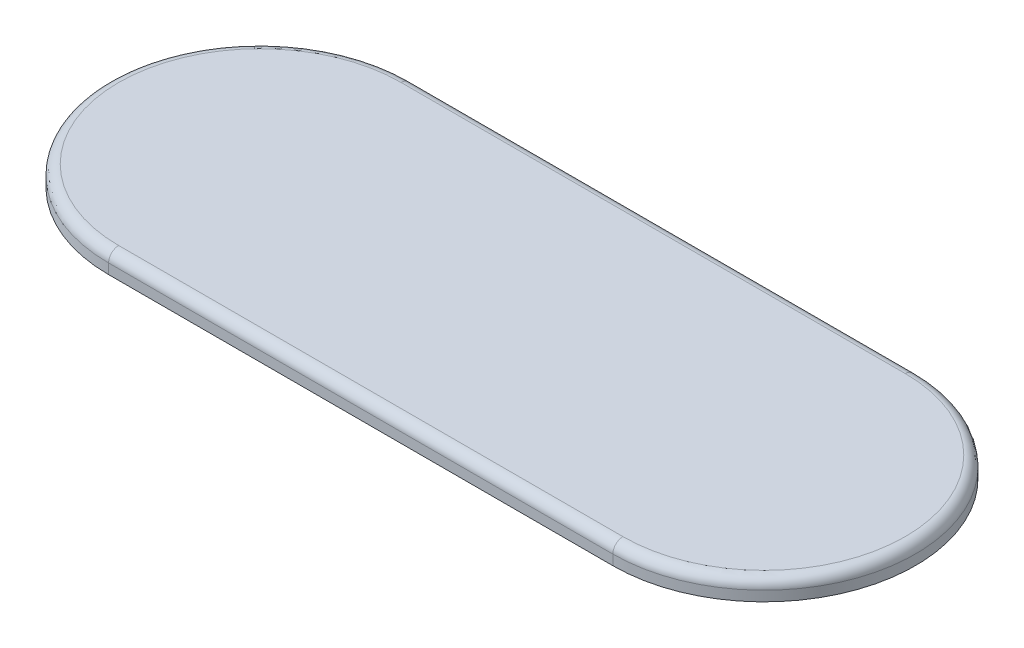
ISO-10303-21;
HEADER;
FILE_DESCRIPTION(('STEP AP214'),'2;1');
FILE_NAME('part.step','',(''),(''),'','','');
FILE_SCHEMA(('AUTOMOTIVE_DESIGN { 1 0 10303 214 1 1 1 1 }'));
ENDSEC;
DATA;
#1=APPLICATION_CONTEXT('core data for automotive mechanical design processes');
#2=APPLICATION_PROTOCOL_DEFINITION('international standard','automotive_design',2000,#1);
#3=PRODUCT_CONTEXT('',#1,'mechanical');
#4=PRODUCT('Part','Part','',(#3));
#5=PRODUCT_RELATED_PRODUCT_CATEGORY('part','',(#4));
#6=PRODUCT_DEFINITION_FORMATION('','',#4);
#7=PRODUCT_DEFINITION_CONTEXT('part definition',#1,'design');
#8=PRODUCT_DEFINITION('design','',#6,#7);
#9=PRODUCT_DEFINITION_SHAPE('','',#8);
#10=(LENGTH_UNIT() NAMED_UNIT(*) SI_UNIT(.MILLI.,.METRE.));
#11=(NAMED_UNIT(*) PLANE_ANGLE_UNIT() SI_UNIT($,.RADIAN.));
#12=(NAMED_UNIT(*) SI_UNIT($,.STERADIAN.) SOLID_ANGLE_UNIT());
#13=UNCERTAINTY_MEASURE_WITH_UNIT(LENGTH_MEASURE(1.E-05),#10,'distance_accuracy_value','');
#14=(GEOMETRIC_REPRESENTATION_CONTEXT(3) GLOBAL_UNCERTAINTY_ASSIGNED_CONTEXT((#13)) GLOBAL_UNIT_ASSIGNED_CONTEXT((#10,
#11,#12)) REPRESENTATION_CONTEXT('',''));
#15=CARTESIAN_POINT('',(0.,0.,0.));
#16=DIRECTION('',(0.,0.,1.));
#17=DIRECTION('',(1.,0.,0.));
#18=AXIS2_PLACEMENT_3D('',#15,#16,#17);
#19=CARTESIAN_POINT('',(0.,2.,0.));
#20=DIRECTION('',(0.,-1.,0.));
#21=DIRECTION('',(0.,0.,-1.));
#22=AXIS2_PLACEMENT_3D('',#19,#20,#21);
#23=CYLINDRICAL_SURFACE('',#22,15.);
#24=DIRECTION('',(0.,-1.,0.));
#25=VECTOR('',#24,1.);
#26=CARTESIAN_POINT('',(0.,2.,15.));
#27=LINE('',#26,#25);
#28=CARTESIAN_POINT('',(0.,1.,15.));
#29=VERTEX_POINT('',#28);
#30=CARTESIAN_POINT('',(0.,0.,15.));
#31=VERTEX_POINT('',#30);
#32=EDGE_CURVE('E85',#29,#31,#27,.T.);
#33=ORIENTED_EDGE('',*,*,#32,.F.);
#34=CARTESIAN_POINT('',(0.,1.,0.));
#35=DIRECTION('',(0.,1.,0.));
#36=DIRECTION('',(0.,0.,1.));
#37=AXIS2_PLACEMENT_3D('',#34,#35,#36);
#38=CIRCLE('',#37,15.);
#39=CARTESIAN_POINT('',(0.,1.,-15.));
#40=VERTEX_POINT('',#39);
#41=EDGE_CURVE('E11',#29,#40,#38,.F.);
#42=ORIENTED_EDGE('',*,*,#41,.T.);
#43=DIRECTION('',(0.,-1.,0.));
#44=VECTOR('',#43,1.);
#45=CARTESIAN_POINT('',(0.,2.,-15.));
#46=LINE('',#45,#44);
#47=CARTESIAN_POINT('',(0.,0.,-15.));
#48=VERTEX_POINT('',#47);
#49=EDGE_CURVE('E106',#40,#48,#46,.T.);
#50=ORIENTED_EDGE('',*,*,#49,.T.);
#51=CARTESIAN_POINT('',(0.,0.,0.));
#52=DIRECTION('',(0.,1.,0.));
#53=DIRECTION('',(0.,0.,1.));
#54=AXIS2_PLACEMENT_3D('',#51,#52,#53);
#55=CIRCLE('',#54,15.);
#56=EDGE_CURVE('E100',#48,#31,#55,.T.);
#57=ORIENTED_EDGE('',*,*,#56,.T.);
#58=EDGE_LOOP('',(#33,#42,#50,#57));
#59=FACE_BOUND('',#58,.T.);
#60=ADVANCED_FACE('F33',(#59),#23,.T.);
#61=CARTESIAN_POINT('',(0.,2.,15.));
#62=DIRECTION('',(0.,0.,-1.));
#63=DIRECTION('',(-1.,0.,0.));
#64=AXIS2_PLACEMENT_3D('',#61,#62,#63);
#65=PLANE('',#64);
#66=DIRECTION('',(0.,-1.,0.));
#67=VECTOR('',#66,1.);
#68=CARTESIAN_POINT('',(50.,2.,15.));
#69=LINE('',#68,#67);
#70=CARTESIAN_POINT('',(50.,1.,15.));
#71=VERTEX_POINT('',#70);
#72=CARTESIAN_POINT('',(50.,0.,15.));
#73=VERTEX_POINT('',#72);
#74=EDGE_CURVE('E94',#71,#73,#69,.T.);
#75=ORIENTED_EDGE('',*,*,#74,.F.);
#76=DIRECTION('',(1.,0.,0.));
#77=VECTOR('',#76,1.);
#78=CARTESIAN_POINT('',(0.,1.,15.));
#79=LINE('',#78,#77);
#80=EDGE_CURVE('E42',#71,#29,#79,.F.);
#81=ORIENTED_EDGE('',*,*,#80,.T.);
#82=ORIENTED_EDGE('',*,*,#32,.T.);
#83=DIRECTION('',(1.,0.,0.));
#84=VECTOR('',#83,1.);
#85=CARTESIAN_POINT('',(0.,0.,15.));
#86=LINE('',#85,#84);
#87=EDGE_CURVE('E88',#31,#73,#86,.T.);
#88=ORIENTED_EDGE('',*,*,#87,.T.);
#89=EDGE_LOOP('',(#75,#81,#82,#88));
#90=FACE_BOUND('',#89,.T.);
#91=ADVANCED_FACE('F87',(#90),#65,.F.);
#92=CARTESIAN_POINT('',(50.,2.,0.));
#93=DIRECTION('',(0.,-1.,0.));
#94=DIRECTION('',(0.,0.,-1.));
#95=AXIS2_PLACEMENT_3D('',#92,#93,#94);
#96=CYLINDRICAL_SURFACE('',#95,15.);
#97=DIRECTION('',(0.,-1.,0.));
#98=VECTOR('',#97,1.);
#99=CARTESIAN_POINT('',(50.,2.,-15.));
#100=LINE('',#99,#98);
#101=CARTESIAN_POINT('',(50.,1.,-15.));
#102=VERTEX_POINT('',#101);
#103=CARTESIAN_POINT('',(50.,0.,-15.));
#104=VERTEX_POINT('',#103);
#105=EDGE_CURVE('E115',#102,#104,#100,.T.);
#106=ORIENTED_EDGE('',*,*,#105,.F.);
#107=CARTESIAN_POINT('',(50.,1.,0.));
#108=DIRECTION('',(0.,1.,0.));
#109=DIRECTION('',(0.,0.,1.));
#110=AXIS2_PLACEMENT_3D('',#107,#108,#109);
#111=CIRCLE('',#110,15.);
#112=EDGE_CURVE('E57',#102,#71,#111,.F.);
#113=ORIENTED_EDGE('',*,*,#112,.T.);
#114=ORIENTED_EDGE('',*,*,#74,.T.);
#115=CARTESIAN_POINT('',(50.,0.,0.));
#116=DIRECTION('',(0.,1.,0.));
#117=DIRECTION('',(0.,0.,1.));
#118=AXIS2_PLACEMENT_3D('',#115,#116,#117);
#119=CIRCLE('',#118,15.);
#120=EDGE_CURVE('E103',#73,#104,#119,.T.);
#121=ORIENTED_EDGE('',*,*,#120,.T.);
#122=EDGE_LOOP('',(#106,#113,#114,#121));
#123=FACE_BOUND('',#122,.T.);
#124=ADVANCED_FACE('F150',(#123),#96,.T.);
#125=CARTESIAN_POINT('',(0.,2.,-15.));
#126=DIRECTION('',(0.,0.,-1.));
#127=DIRECTION('',(-1.,0.,0.));
#128=AXIS2_PLACEMENT_3D('',#125,#126,#127);
#129=PLANE('',#128);
#130=ORIENTED_EDGE('',*,*,#49,.F.);
#131=DIRECTION('',(1.,0.,0.));
#132=VECTOR('',#131,1.);
#133=CARTESIAN_POINT('',(0.,1.,-15.));
#134=LINE('',#133,#132);
#135=EDGE_CURVE('E93',#40,#102,#134,.T.);
#136=ORIENTED_EDGE('',*,*,#135,.T.);
#137=ORIENTED_EDGE('',*,*,#105,.T.);
#138=DIRECTION('',(1.,0.,0.));
#139=VECTOR('',#138,1.);
#140=CARTESIAN_POINT('',(0.,0.,-15.));
#141=LINE('',#140,#139);
#142=EDGE_CURVE('E112',#48,#104,#141,.T.);
#143=ORIENTED_EDGE('',*,*,#142,.F.);
#144=EDGE_LOOP('',(#130,#136,#137,#143));
#145=FACE_BOUND('',#144,.T.);
#146=ADVANCED_FACE('F149',(#145),#129,.T.);
#147=CARTESIAN_POINT('',(0.,2.,0.));
#148=DIRECTION('',(0.,1.,0.));
#149=DIRECTION('',(0.,0.,1.));
#150=AXIS2_PLACEMENT_3D('',#147,#148,#149);
#151=PLANE('',#150);
#152=CARTESIAN_POINT('',(50.,2.,0.));
#153=DIRECTION('',(0.,1.,0.));
#154=DIRECTION('',(0.,0.,1.));
#155=AXIS2_PLACEMENT_3D('',#152,#153,#154);
#156=CIRCLE('',#155,14.);
#157=CARTESIAN_POINT('',(50.,2.,14.));
#158=VERTEX_POINT('',#157);
#159=CARTESIAN_POINT('',(50.,2.,-14.));
#160=VERTEX_POINT('',#159);
#161=EDGE_CURVE('E124',#158,#160,#156,.T.);
#162=ORIENTED_EDGE('',*,*,#161,.T.);
#163=DIRECTION('',(1.,0.,0.));
#164=VECTOR('',#163,1.);
#165=CARTESIAN_POINT('',(0.,2.,-14.));
#166=LINE('',#165,#164);
#167=CARTESIAN_POINT('',(0.,2.,-14.));
#168=VERTEX_POINT('',#167);
#169=EDGE_CURVE('E126',#160,#168,#166,.F.);
#170=ORIENTED_EDGE('',*,*,#169,.T.);
#171=CARTESIAN_POINT('',(0.,2.,0.));
#172=DIRECTION('',(0.,1.,0.));
#173=DIRECTION('',(0.,0.,1.));
#174=AXIS2_PLACEMENT_3D('',#171,#172,#173);
#175=CIRCLE('',#174,14.);
#176=CARTESIAN_POINT('',(0.,2.,14.));
#177=VERTEX_POINT('',#176);
#178=EDGE_CURVE('E120',#168,#177,#175,.T.);
#179=ORIENTED_EDGE('',*,*,#178,.T.);
#180=DIRECTION('',(1.,0.,0.));
#181=VECTOR('',#180,1.);
#182=CARTESIAN_POINT('',(50.,2.,14.));
#183=LINE('',#182,#181);
#184=EDGE_CURVE('E122',#177,#158,#183,.T.);
#185=ORIENTED_EDGE('',*,*,#184,.T.);
#186=EDGE_LOOP('',(#162,#170,#179,#185));
#187=FACE_BOUND('',#186,.T.);
#188=ADVANCED_FACE('F157',(#187),#151,.T.);
#189=CARTESIAN_POINT('',(0.,0.,0.));
#190=DIRECTION('',(0.,1.,0.));
#191=DIRECTION('',(0.,0.,1.));
#192=AXIS2_PLACEMENT_3D('',#189,#190,#191);
#193=PLANE('',#192);
#194=ORIENTED_EDGE('',*,*,#56,.F.);
#195=ORIENTED_EDGE('',*,*,#142,.T.);
#196=ORIENTED_EDGE('',*,*,#120,.F.);
#197=ORIENTED_EDGE('',*,*,#87,.F.);
#198=EDGE_LOOP('',(#194,#195,#196,#197));
#199=FACE_BOUND('',#198,.T.);
#200=ADVANCED_FACE('F98',(#199),#193,.F.);
#201=CARTESIAN_POINT('',(0.,1.,14.));
#202=DIRECTION('',(-1.,0.,0.));
#203=DIRECTION('',(0.,0.,1.));
#204=AXIS2_PLACEMENT_3D('',#201,#202,#203);
#205=CYLINDRICAL_SURFACE('',#204,1.);
#206=CARTESIAN_POINT('',(50.,1.,14.));
#207=DIRECTION('',(1.,0.,0.));
#208=DIRECTION('',(0.,0.,-1.));
#209=AXIS2_PLACEMENT_3D('',#206,#207,#208);
#210=CIRCLE('',#209,1.);
#211=EDGE_CURVE('E109',#158,#71,#210,.T.);
#212=ORIENTED_EDGE('',*,*,#211,.F.);
#213=ORIENTED_EDGE('',*,*,#184,.F.);
#214=CARTESIAN_POINT('',(0.,1.,14.));
#215=DIRECTION('',(-1.,0.,0.));
#216=DIRECTION('',(0.,0.,1.));
#217=AXIS2_PLACEMENT_3D('',#214,#215,#216);
#218=CIRCLE('',#217,1.);
#219=EDGE_CURVE('E37',#29,#177,#218,.T.);
#220=ORIENTED_EDGE('',*,*,#219,.F.);
#221=ORIENTED_EDGE('',*,*,#80,.F.);
#222=EDGE_LOOP('',(#212,#213,#220,#221));
#223=FACE_BOUND('',#222,.T.);
#224=ADVANCED_FACE('F35',(#223),#205,.T.);
#225=CARTESIAN_POINT('',(0.,1.,0.));
#226=DIRECTION('',(0.,1.,0.));
#227=DIRECTION('',(0.,0.,1.));
#228=AXIS2_PLACEMENT_3D('',#225,#226,#227);
#229=TOROIDAL_SURFACE('',#228,14.,1.);
#230=ORIENTED_EDGE('',*,*,#219,.T.);
#231=ORIENTED_EDGE('',*,*,#178,.F.);
#232=CARTESIAN_POINT('',(0.,1.,-14.));
#233=DIRECTION('',(1.,0.,0.));
#234=DIRECTION('',(0.,0.,-1.));
#235=AXIS2_PLACEMENT_3D('',#232,#233,#234);
#236=CIRCLE('',#235,1.);
#237=EDGE_CURVE('E133',#40,#168,#236,.T.);
#238=ORIENTED_EDGE('',*,*,#237,.F.);
#239=ORIENTED_EDGE('',*,*,#41,.F.);
#240=EDGE_LOOP('',(#230,#231,#238,#239));
#241=FACE_BOUND('',#240,.T.);
#242=ADVANCED_FACE('F146',(#241),#229,.T.);
#243=CARTESIAN_POINT('',(50.,1.,0.));
#244=DIRECTION('',(0.,1.,0.));
#245=DIRECTION('',(0.,0.,1.));
#246=AXIS2_PLACEMENT_3D('',#243,#244,#245);
#247=TOROIDAL_SURFACE('',#246,14.,1.);
#248=ORIENTED_EDGE('',*,*,#211,.T.);
#249=ORIENTED_EDGE('',*,*,#112,.F.);
#250=CARTESIAN_POINT('',(50.,1.,-14.));
#251=DIRECTION('',(-1.,0.,0.));
#252=DIRECTION('',(0.,0.,1.));
#253=AXIS2_PLACEMENT_3D('',#250,#251,#252);
#254=CIRCLE('',#253,1.);
#255=EDGE_CURVE('E131',#160,#102,#254,.T.);
#256=ORIENTED_EDGE('',*,*,#255,.F.);
#257=ORIENTED_EDGE('',*,*,#161,.F.);
#258=EDGE_LOOP('',(#248,#249,#256,#257));
#259=FACE_BOUND('',#258,.T.);
#260=ADVANCED_FACE('F138',(#259),#247,.T.);
#261=CARTESIAN_POINT('',(0.,1.,-14.));
#262=DIRECTION('',(1.,0.,0.));
#263=DIRECTION('',(0.,0.,-1.));
#264=AXIS2_PLACEMENT_3D('',#261,#262,#263);
#265=CYLINDRICAL_SURFACE('',#264,1.);
#266=ORIENTED_EDGE('',*,*,#237,.T.);
#267=ORIENTED_EDGE('',*,*,#169,.F.);
#268=ORIENTED_EDGE('',*,*,#255,.T.);
#269=ORIENTED_EDGE('',*,*,#135,.F.);
#270=EDGE_LOOP('',(#266,#267,#268,#269));
#271=FACE_BOUND('',#270,.T.);
#272=ADVANCED_FACE('F165',(#271),#265,.T.);
#273=CLOSED_SHELL('',(#60,#91,#124,#146,#188,#200,#224,#242,#260,#272));
#274=MANIFOLD_SOLID_BREP('B2',#273);
#275=ADVANCED_BREP_SHAPE_REPRESENTATION('',(#18,#274),#14);
#276=SHAPE_DEFINITION_REPRESENTATION(#9,#275);
ENDSEC;
END-ISO-10303-21;
